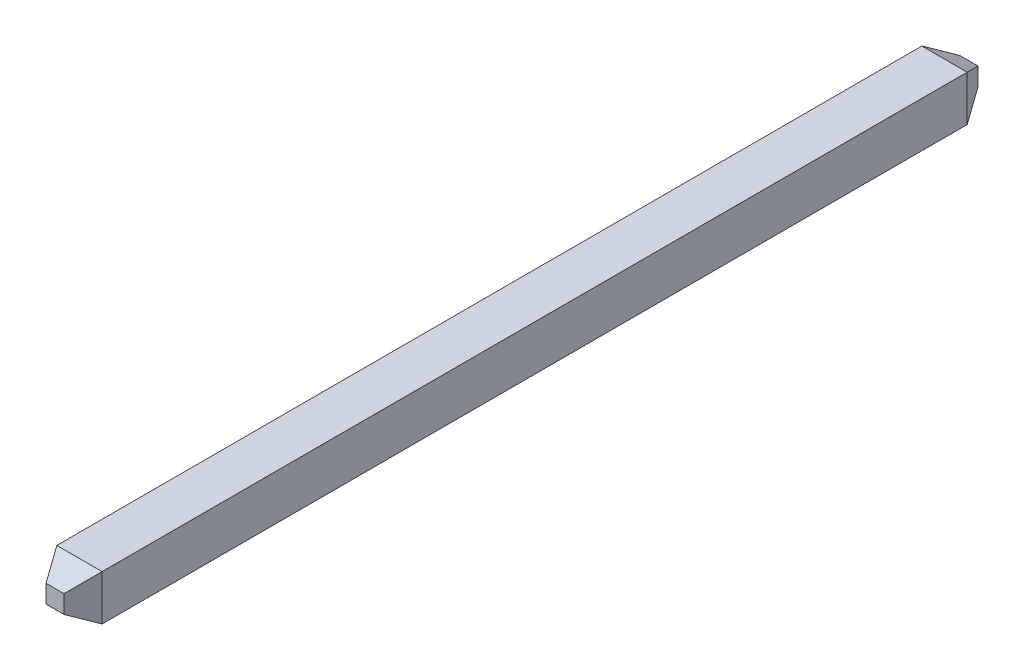
ISO-10303-21;
HEADER;
FILE_DESCRIPTION(('STEP AP214'),'2;1');
FILE_NAME('part.step','',(''),(''),'','','');
FILE_SCHEMA(('AUTOMOTIVE_DESIGN { 1 0 10303 214 1 1 1 1 }'));
ENDSEC;
DATA;
#1=APPLICATION_CONTEXT('core data for automotive mechanical design processes');
#2=APPLICATION_PROTOCOL_DEFINITION('international standard','automotive_design',2000,#1);
#3=PRODUCT_CONTEXT('',#1,'mechanical');
#4=PRODUCT('Part','Part','',(#3));
#5=PRODUCT_RELATED_PRODUCT_CATEGORY('part','',(#4));
#6=PRODUCT_DEFINITION_FORMATION('','',#4);
#7=PRODUCT_DEFINITION_CONTEXT('part definition',#1,'design');
#8=PRODUCT_DEFINITION('design','',#6,#7);
#9=PRODUCT_DEFINITION_SHAPE('','',#8);
#10=(LENGTH_UNIT() NAMED_UNIT(*) SI_UNIT(.MILLI.,.METRE.));
#11=(NAMED_UNIT(*) PLANE_ANGLE_UNIT() SI_UNIT($,.RADIAN.));
#12=(NAMED_UNIT(*) SI_UNIT($,.STERADIAN.) SOLID_ANGLE_UNIT());
#13=UNCERTAINTY_MEASURE_WITH_UNIT(LENGTH_MEASURE(1.E-05),#10,'distance_accuracy_value','');
#14=(GEOMETRIC_REPRESENTATION_CONTEXT(3) GLOBAL_UNCERTAINTY_ASSIGNED_CONTEXT((#13)) GLOBAL_UNIT_ASSIGNED_CONTEXT((#10,
#11,#12)) REPRESENTATION_CONTEXT('',''));
#15=CARTESIAN_POINT('',(0.,0.,0.));
#16=DIRECTION('',(0.,0.,1.));
#17=DIRECTION('',(1.,0.,0.));
#18=AXIS2_PLACEMENT_3D('',#15,#16,#17);
#19=CARTESIAN_POINT('',(5.20011510041924,0.945,-3.20872569516347));
#20=DIRECTION('',(0.872569516347453,0.,-0.488489958076081));
#21=DIRECTION('',(-0.488489958076081,0.,-0.872569516347453));
#22=AXIS2_PLACEMENT_3D('',#19,#20,#21);
#23=PLANE('',#22);
#24=DIRECTION('',(0.,1.,0.));
#25=VECTOR('',#24,1.);
#26=CARTESIAN_POINT('',(5.39534185664468,0.944999999999999,-2.86000017186176));
#27=LINE('',#26,#25);
#28=CARTESIAN_POINT('',(5.39534185663263,0.954999975315067,-2.85999984563027));
#29=VERTEX_POINT('',#28);
#30=CARTESIAN_POINT('',(5.39534201729187,1.58500016035866,-2.8599998849043));
#31=VERTEX_POINT('',#30);
#32=EDGE_CURVE('E118',#29,#31,#27,.T.);
#33=ORIENTED_EDGE('',*,*,#32,.F.);
#34=DIRECTION('',(0.43907261756865,-0.438284036988111,0.784297353956278));
#35=VECTOR('',#34,1.);
#36=CARTESIAN_POINT('',(5.205,1.145,-3.2));
#37=LINE('',#36,#35);
#38=CARTESIAN_POINT('',(5.205,1.145,-3.2));
#39=VERTEX_POINT('',#38);
#40=EDGE_CURVE('E116',#39,#29,#37,.T.);
#41=ORIENTED_EDGE('',*,*,#40,.F.);
#42=DIRECTION('',(0.,1.,0.));
#43=VECTOR('',#42,1.);
#44=CARTESIAN_POINT('',(5.205,1.135,-3.2));
#45=LINE('',#44,#43);
#46=CARTESIAN_POINT('',(5.205,1.395,-3.2));
#47=VERTEX_POINT('',#46);
#48=EDGE_CURVE('E79',#47,#39,#45,.F.);
#49=ORIENTED_EDGE('',*,*,#48,.F.);
#50=DIRECTION('',(-0.439072617568649,-0.438284036988111,-0.784297353956278));
#51=VECTOR('',#50,1.);
#52=CARTESIAN_POINT('',(5.39534185664468,1.585,-2.86000017186176));
#53=LINE('',#52,#51);
#54=EDGE_CURVE('E110',#31,#47,#53,.T.);
#55=ORIENTED_EDGE('',*,*,#54,.F.);
#56=EDGE_LOOP('',(#33,#41,#49,#55));
#57=FACE_BOUND('',#56,.T.);
#58=ADVANCED_FACE('F17',(#57),#23,.T.);
#59=CARTESIAN_POINT('',(5.20036702814295,0.945,9.50441734607014));
#60=DIRECTION('',(0.873317045523297,0.,0.487152273933377));
#61=DIRECTION('',(0.487152273933377,0.,-0.873317045523297));
#62=AXIS2_PLACEMENT_3D('',#59,#60,#61);
#63=PLANE('',#62);
#64=DIRECTION('',(-0.437799852400894,0.438586917260846,0.784839349959839));
#65=VECTOR('',#64,1.);
#66=CARTESIAN_POINT('',(5.39489789955164,0.954999686828527,9.15568378706484));
#67=LINE('',#66,#65);
#68=CARTESIAN_POINT('',(5.39489765454992,0.954999891076848,9.15568368845103));
#69=VERTEX_POINT('',#68);
#70=CARTESIAN_POINT('',(5.20523855088228,1.145,9.49568417561491));
#71=VERTEX_POINT('',#70);
#72=EDGE_CURVE('E122',#69,#71,#67,.T.);
#73=ORIENTED_EDGE('',*,*,#72,.F.);
#74=DIRECTION('',(0.,1.,0.));
#75=VECTOR('',#74,1.);
#76=CARTESIAN_POINT('',(5.39489853900642,0.944999999999999,9.155683722437));
#77=LINE('',#76,#75);
#78=CARTESIAN_POINT('',(5.39489765280461,1.5850001770326,9.15568371270386));
#79=VERTEX_POINT('',#78);
#80=EDGE_CURVE('E89',#79,#69,#77,.F.);
#81=ORIENTED_EDGE('',*,*,#80,.F.);
#82=DIRECTION('',(0.437799852400903,0.438586917260844,-0.784839349959835));
#83=VECTOR('',#82,1.);
#84=CARTESIAN_POINT('',(5.20523855088228,1.395,9.49568417561491));
#85=LINE('',#84,#83);
#86=CARTESIAN_POINT('',(5.20523855088228,1.395,9.49568417561491));
#87=VERTEX_POINT('',#86);
#88=EDGE_CURVE('E84',#87,#79,#85,.T.);
#89=ORIENTED_EDGE('',*,*,#88,.F.);
#90=DIRECTION('',(0.,1.,0.));
#91=VECTOR('',#90,1.);
#92=CARTESIAN_POINT('',(5.20523855088228,1.405,9.49568417561491));
#93=LINE('',#92,#91);
#94=EDGE_CURVE('E20',#71,#87,#93,.T.);
#95=ORIENTED_EDGE('',*,*,#94,.F.);
#96=EDGE_LOOP('',(#73,#81,#89,#95));
#97=FACE_BOUND('',#96,.T.);
#98=ADVANCED_FACE('F86',(#97),#63,.T.);
#99=CARTESIAN_POINT('',(4.94523855088228,1.405,9.49568417561491));
#100=DIRECTION('',(0.,0.,1.));
#101=DIRECTION('',(1.,0.,0.));
#102=AXIS2_PLACEMENT_3D('',#99,#100,#101);
#103=PLANE('',#102);
#104=DIRECTION('',(1.,0.,0.));
#105=VECTOR('',#104,1.);
#106=CARTESIAN_POINT('',(4.7548966942376,1.395,9.49568417561491));
#107=LINE('',#106,#105);
#108=CARTESIAN_POINT('',(4.95523855088228,1.395,9.49568417561491));
#109=VERTEX_POINT('',#108);
#110=EDGE_CURVE('E93',#109,#87,#107,.T.);
#111=ORIENTED_EDGE('',*,*,#110,.F.);
#112=DIRECTION('',(0.,1.,0.));
#113=VECTOR('',#112,1.);
#114=CARTESIAN_POINT('',(4.95523855088228,0.945,9.49568417561491));
#115=LINE('',#114,#113);
#116=CARTESIAN_POINT('',(4.95523855088228,1.145,9.49568417561491));
#117=VERTEX_POINT('',#116);
#118=EDGE_CURVE('E129',#117,#109,#115,.T.);
#119=ORIENTED_EDGE('',*,*,#118,.F.);
#120=DIRECTION('',(1.,0.,0.));
#121=VECTOR('',#120,1.);
#122=CARTESIAN_POINT('',(4.7548966942376,1.145,9.49568417561491));
#123=LINE('',#122,#121);
#124=EDGE_CURVE('E98',#71,#117,#123,.F.);
#125=ORIENTED_EDGE('',*,*,#124,.F.);
#126=ORIENTED_EDGE('',*,*,#94,.T.);
#127=EDGE_LOOP('',(#111,#119,#125,#126));
#128=FACE_BOUND('',#127,.T.);
#129=ADVANCED_FACE('F95',(#128),#103,.T.);
#130=CARTESIAN_POINT('',(4.7548966942376,1.39012178454432,9.50441360938624));
#131=DIRECTION('',(0.,0.872943377132664,0.487821545567864));
#132=DIRECTION('',(0.,-0.487821545567864,0.872943377132664));
#133=AXIS2_PLACEMENT_3D('',#130,#131,#132);
#134=PLANE('',#133);
#135=DIRECTION('',(-0.439072459537936,0.438284700441641,-0.78429707167252));
#136=VECTOR('',#135,1.);
#137=CARTESIAN_POINT('',(4.95523855088228,1.395,9.49568417561491));
#138=LINE('',#137,#136);
#139=CARTESIAN_POINT('',(4.7648975037028,1.58500008247257,9.15568447138297));
#140=VERTEX_POINT('',#139);
#141=EDGE_CURVE('E102',#109,#140,#138,.T.);
#142=ORIENTED_EDGE('',*,*,#141,.F.);
#143=ORIENTED_EDGE('',*,*,#110,.T.);
#144=ORIENTED_EDGE('',*,*,#88,.T.);
#145=DIRECTION('',(1.,0.,0.));
#146=VECTOR('',#145,1.);
#147=CARTESIAN_POINT('',(5.08006658937282,1.585,9.15568497320463));
#148=LINE('',#147,#146);
#149=EDGE_CURVE('E131',#140,#79,#148,.T.);
#150=ORIENTED_EDGE('',*,*,#149,.F.);
#151=EDGE_LOOP('',(#142,#143,#144,#150));
#152=FACE_BOUND('',#151,.T.);
#153=ADVANCED_FACE('F100',(#152),#134,.T.);
#154=CARTESIAN_POINT('',(4.945,1.135,-3.2));
#155=DIRECTION('',(0.,0.,-1.));
#156=DIRECTION('',(-1.,0.,0.));
#157=AXIS2_PLACEMENT_3D('',#154,#155,#156);
#158=PLANE('',#157);
#159=ORIENTED_EDGE('',*,*,#48,.T.);
#160=DIRECTION('',(1.,0.,0.));
#161=VECTOR('',#160,1.);
#162=CARTESIAN_POINT('',(4.75534185664468,1.145,-3.2));
#163=LINE('',#162,#161);
#164=CARTESIAN_POINT('',(4.955,1.145,-3.2));
#165=VERTEX_POINT('',#164);
#166=EDGE_CURVE('E113',#165,#39,#163,.T.);
#167=ORIENTED_EDGE('',*,*,#166,.F.);
#168=DIRECTION('',(0.,1.,0.));
#169=VECTOR('',#168,1.);
#170=CARTESIAN_POINT('',(4.955,0.945,-3.2));
#171=LINE('',#170,#169);
#172=CARTESIAN_POINT('',(4.955,1.395,-3.2));
#173=VERTEX_POINT('',#172);
#174=EDGE_CURVE('E140',#173,#165,#171,.F.);
#175=ORIENTED_EDGE('',*,*,#174,.F.);
#176=DIRECTION('',(1.,0.,0.));
#177=VECTOR('',#176,1.);
#178=CARTESIAN_POINT('',(4.75534185664468,1.395,-3.2));
#179=LINE('',#178,#177);
#180=EDGE_CURVE('E105',#47,#173,#179,.F.);
#181=ORIENTED_EDGE('',*,*,#180,.F.);
#182=EDGE_LOOP('',(#159,#167,#175,#181));
#183=FACE_BOUND('',#182,.T.);
#184=ADVANCED_FACE('F184',(#183),#158,.T.);
#185=CARTESIAN_POINT('',(4.75534185664468,1.58987821545568,-2.85127073809043));
#186=DIRECTION('',(0.,0.872943377132663,-0.487821545567865));
#187=DIRECTION('',(0.,0.487821545567865,0.872943377132663));
#188=AXIS2_PLACEMENT_3D('',#185,#186,#187);
#189=PLANE('',#188);
#190=DIRECTION('',(1.,0.,0.));
#191=VECTOR('',#190,1.);
#192=CARTESIAN_POINT('',(5.08006658937282,1.585,-2.86000017186176));
#193=LINE('',#192,#191);
#194=CARTESIAN_POINT('',(4.76534144768619,1.5850007068091,-2.8599984305592));
#195=VERTEX_POINT('',#194);
#196=EDGE_CURVE('E137',#31,#195,#193,.F.);
#197=ORIENTED_EDGE('',*,*,#196,.F.);
#198=ORIENTED_EDGE('',*,*,#54,.T.);
#199=ORIENTED_EDGE('',*,*,#180,.T.);
#200=DIRECTION('',(0.437798396819593,-0.438586429089661,-0.784840434713054));
#201=VECTOR('',#200,1.);
#202=CARTESIAN_POINT('',(4.76534066407532,1.58500072063078,-2.85999803394471));
#203=LINE('',#202,#201);
#204=EDGE_CURVE('E145',#195,#173,#203,.T.);
#205=ORIENTED_EDGE('',*,*,#204,.F.);
#206=EDGE_LOOP('',(#197,#198,#199,#205));
#207=FACE_BOUND('',#206,.T.);
#208=ADVANCED_FACE('F182',(#207),#189,.T.);
#209=CARTESIAN_POINT('',(4.75534185664468,1.14987821545568,-3.20872943377133));
#210=DIRECTION('',(0.,-0.872943377132663,-0.487821545567865));
#211=DIRECTION('',(0.,0.487821545567865,-0.872943377132663));
#212=AXIS2_PLACEMENT_3D('',#209,#210,#211);
#213=PLANE('',#212);
#214=ORIENTED_EDGE('',*,*,#166,.T.);
#215=ORIENTED_EDGE('',*,*,#40,.T.);
#216=DIRECTION('',(1.,0.,0.));
#217=VECTOR('',#216,1.);
#218=CARTESIAN_POINT('',(4.75494834685547,0.955,-2.85999756200982));
#219=LINE('',#218,#217);
#220=CARTESIAN_POINT('',(4.76534198218488,0.954999729763457,-2.85999898491791));
#221=VERTEX_POINT('',#220);
#222=EDGE_CURVE('E35',#221,#29,#219,.T.);
#223=ORIENTED_EDGE('',*,*,#222,.F.);
#224=DIRECTION('',(-0.437798396819592,-0.438586429089664,0.784840434713052));
#225=VECTOR('',#224,1.);
#226=CARTESIAN_POINT('',(4.955,1.145,-3.2));
#227=LINE('',#226,#225);
#228=EDGE_CURVE('E143',#165,#221,#227,.T.);
#229=ORIENTED_EDGE('',*,*,#228,.F.);
#230=EDGE_LOOP('',(#214,#215,#223,#229));
#231=FACE_BOUND('',#230,.T.);
#232=ADVANCED_FACE('F185',(#231),#213,.T.);
#233=CARTESIAN_POINT('',(5.39534630826875,0.944999999999999,-2.98065701705514));
#234=DIRECTION('',(0.999999999319383,0.,3.68949151672057E-05));
#235=DIRECTION('',(3.68949151672057E-05,0.,-0.999999999319383));
#236=AXIS2_PLACEMENT_3D('',#233,#234,#235);
#237=PLANE('',#236);
#238=DIRECTION('',(3.69481335098094E-05,0.,-0.999999999317418));
#239=VECTOR('',#238,1.);
#240=CARTESIAN_POINT('',(5.39489789955164,1.585,9.1556837224134));
#241=LINE('',#240,#239);
#242=EDGE_CURVE('E134',#79,#31,#241,.T.);
#243=ORIENTED_EDGE('',*,*,#242,.F.);
#244=ORIENTED_EDGE('',*,*,#80,.T.);
#245=DIRECTION('',(-3.69481335098094E-05,0.,0.999999999317418));
#246=VECTOR('',#245,1.);
#247=CARTESIAN_POINT('',(5.39534185664468,0.955,-2.86000017186176));
#248=LINE('',#247,#246);
#249=EDGE_CURVE('E149',#29,#69,#248,.T.);
#250=ORIENTED_EDGE('',*,*,#249,.F.);
#251=ORIENTED_EDGE('',*,*,#32,.T.);
#252=EDGE_LOOP('',(#243,#244,#250,#251));
#253=FACE_BOUND('',#252,.T.);
#254=ADVANCED_FACE('F187',(#253),#237,.T.);
#255=CARTESIAN_POINT('',(4.7548966942376,0.950121784544321,9.14695491370534));
#256=DIRECTION('',(0.,-0.872943377132664,0.487821545567865));
#257=DIRECTION('',(0.,-0.487821545567865,-0.872943377132664));
#258=AXIS2_PLACEMENT_3D('',#255,#256,#257);
#259=PLANE('',#258);
#260=ORIENTED_EDGE('',*,*,#124,.T.);
#261=DIRECTION('',(0.439072459537931,0.438284700441657,0.784297071672513));
#262=VECTOR('',#261,1.);
#263=CARTESIAN_POINT('',(4.76489724886554,0.955000197635095,9.15568533818575));
#264=LINE('',#263,#262);
#265=CARTESIAN_POINT('',(4.76489781760237,0.955000116075707,9.15568487573228));
#266=VERTEX_POINT('',#265);
#267=EDGE_CURVE('E126',#266,#117,#264,.T.);
#268=ORIENTED_EDGE('',*,*,#267,.F.);
#269=DIRECTION('',(1.,0.,0.));
#270=VECTOR('',#269,1.);
#271=CARTESIAN_POINT('',(4.75494834685547,0.955,9.15568372241339));
#272=LINE('',#271,#270);
#273=EDGE_CURVE('E152',#69,#266,#272,.F.);
#274=ORIENTED_EDGE('',*,*,#273,.F.);
#275=ORIENTED_EDGE('',*,*,#72,.T.);
#276=EDGE_LOOP('',(#260,#268,#274,#275));
#277=FACE_BOUND('',#276,.T.);
#278=ADVANCED_FACE('F174',(#277),#259,.T.);
#279=CARTESIAN_POINT('',(4.96012345046304,0.945,9.50440987077839));
#280=DIRECTION('',(-0.872569516347453,0.,0.488489958076081));
#281=DIRECTION('',(0.488489958076081,0.,0.872569516347453));
#282=AXIS2_PLACEMENT_3D('',#279,#280,#281);
#283=PLANE('',#282);
#284=ORIENTED_EDGE('',*,*,#267,.T.);
#285=ORIENTED_EDGE('',*,*,#118,.T.);
#286=ORIENTED_EDGE('',*,*,#141,.T.);
#287=DIRECTION('',(0.,1.,0.));
#288=VECTOR('',#287,1.);
#289=CARTESIAN_POINT('',(4.76489853896028,0.945,9.15568497322818));
#290=LINE('',#289,#288);
#291=EDGE_CURVE('E155',#266,#140,#290,.T.);
#292=ORIENTED_EDGE('',*,*,#291,.F.);
#293=EDGE_LOOP('',(#284,#285,#286,#292));
#294=FACE_BOUND('',#293,.T.);
#295=ADVANCED_FACE('F177',(#294),#283,.T.);
#296=CARTESIAN_POINT('',(5.08006658937282,1.585,9.32634470275115));
#297=DIRECTION('',(0.,1.,0.));
#298=DIRECTION('',(0.,0.,1.));
#299=AXIS2_PLACEMENT_3D('',#296,#297,#298);
#300=PLANE('',#299);
#301=ORIENTED_EDGE('',*,*,#196,.T.);
#302=DIRECTION('',(-3.68949151674615E-05,0.,0.999999999319383));
#303=VECTOR('',#302,1.);
#304=CARTESIAN_POINT('',(4.76489224235438,1.5849998023649,9.32634821671993));
#305=LINE('',#304,#303);
#306=EDGE_CURVE('E158',#140,#195,#305,.F.);
#307=ORIENTED_EDGE('',*,*,#306,.F.);
#308=ORIENTED_EDGE('',*,*,#149,.T.);
#309=ORIENTED_EDGE('',*,*,#242,.T.);
#310=EDGE_LOOP('',(#301,#307,#308,#309));
#311=FACE_BOUND('',#310,.T.);
#312=ADVANCED_FACE('F179',(#311),#300,.T.);
#313=CARTESIAN_POINT('',(4.95987152273933,0.945,-3.20873317045523));
#314=DIRECTION('',(-0.873317045523297,0.,-0.487152273933377));
#315=DIRECTION('',(-0.487152273933377,0.,0.873317045523297));
#316=AXIS2_PLACEMENT_3D('',#313,#314,#315);
#317=PLANE('',#316);
#318=DIRECTION('',(0.,1.,0.));
#319=VECTOR('',#318,1.);
#320=CARTESIAN_POINT('',(4.76534185654839,0.945,-2.85999756199704));
#321=LINE('',#320,#319);
#322=EDGE_CURVE('E26',#195,#221,#321,.F.);
#323=ORIENTED_EDGE('',*,*,#322,.F.);
#324=ORIENTED_EDGE('',*,*,#204,.T.);
#325=ORIENTED_EDGE('',*,*,#174,.T.);
#326=ORIENTED_EDGE('',*,*,#228,.T.);
#327=EDGE_LOOP('',(#323,#324,#325,#326));
#328=FACE_BOUND('',#327,.T.);
#329=ADVANCED_FACE('F168',(#328),#317,.T.);
#330=CARTESIAN_POINT('',(4.75494834685547,0.955,3.17284922525592));
#331=DIRECTION('',(0.,-1.,0.));
#332=DIRECTION('',(0.,0.,-1.));
#333=AXIS2_PLACEMENT_3D('',#330,#331,#332);
#334=PLANE('',#333);
#335=ORIENTED_EDGE('',*,*,#249,.T.);
#336=ORIENTED_EDGE('',*,*,#273,.T.);
#337=DIRECTION('',(-3.68949151674615E-05,0.,0.999999999319383));
#338=VECTOR('',#337,1.);
#339=CARTESIAN_POINT('',(4.76489224235438,0.954999279369218,9.32634821671993));
#340=LINE('',#339,#338);
#341=EDGE_CURVE('E11',#221,#266,#340,.T.);
#342=ORIENTED_EDGE('',*,*,#341,.F.);
#343=ORIENTED_EDGE('',*,*,#222,.T.);
#344=EDGE_LOOP('',(#335,#336,#342,#343));
#345=FACE_BOUND('',#344,.T.);
#346=ADVANCED_FACE('F170',(#345),#334,.T.);
#347=CARTESIAN_POINT('',(4.76489224235438,0.945,9.32634821671993));
#348=DIRECTION('',(-0.999999999319383,0.,-3.68949151674615E-05));
#349=DIRECTION('',(-3.68949151674615E-05,0.,0.999999999319383));
#350=AXIS2_PLACEMENT_3D('',#347,#348,#349);
#351=PLANE('',#350);
#352=ORIENTED_EDGE('',*,*,#322,.T.);
#353=ORIENTED_EDGE('',*,*,#341,.T.);
#354=ORIENTED_EDGE('',*,*,#291,.T.);
#355=ORIENTED_EDGE('',*,*,#306,.T.);
#356=EDGE_LOOP('',(#352,#353,#354,#355));
#357=FACE_BOUND('',#356,.T.);
#358=ADVANCED_FACE('F164',(#357),#351,.T.);
#359=CLOSED_SHELL('',(#58,#98,#129,#153,#184,#208,#232,#254,#278,#295,#312,#329,#346,#358));
#360=MANIFOLD_SOLID_BREP('B1',#359);
#361=ADVANCED_BREP_SHAPE_REPRESENTATION('',(#18,#360),#14);
#362=SHAPE_DEFINITION_REPRESENTATION(#9,#361);
ENDSEC;
END-ISO-10303-21;
